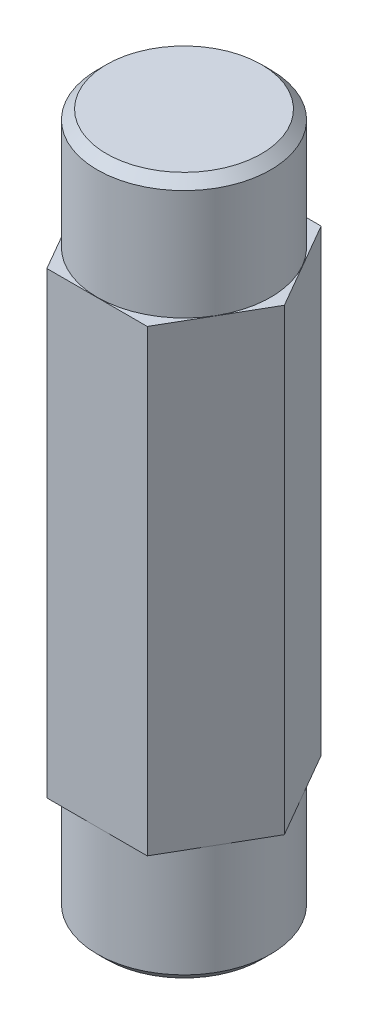
ISO-10303-21;
HEADER;
FILE_DESCRIPTION(('STEP AP214'),'2;1');
FILE_NAME('part.step','',(''),(''),'','','');
FILE_SCHEMA(('AUTOMOTIVE_DESIGN { 1 0 10303 214 1 1 1 1 }'));
ENDSEC;
DATA;
#1=APPLICATION_CONTEXT('core data for automotive mechanical design processes');
#2=APPLICATION_PROTOCOL_DEFINITION('international standard','automotive_design',2000,#1);
#3=PRODUCT_CONTEXT('',#1,'mechanical');
#4=PRODUCT('Part','Part','',(#3));
#5=PRODUCT_RELATED_PRODUCT_CATEGORY('part','',(#4));
#6=PRODUCT_DEFINITION_FORMATION('','',#4);
#7=PRODUCT_DEFINITION_CONTEXT('part definition',#1,'design');
#8=PRODUCT_DEFINITION('design','',#6,#7);
#9=PRODUCT_DEFINITION_SHAPE('','',#8);
#10=(LENGTH_UNIT() NAMED_UNIT(*) SI_UNIT(.MILLI.,.METRE.));
#11=(NAMED_UNIT(*) PLANE_ANGLE_UNIT() SI_UNIT($,.RADIAN.));
#12=(NAMED_UNIT(*) SI_UNIT($,.STERADIAN.) SOLID_ANGLE_UNIT());
#13=UNCERTAINTY_MEASURE_WITH_UNIT(LENGTH_MEASURE(1.E-05),#10,'distance_accuracy_value','');
#14=(GEOMETRIC_REPRESENTATION_CONTEXT(3) GLOBAL_UNCERTAINTY_ASSIGNED_CONTEXT((#13)) GLOBAL_UNIT_ASSIGNED_CONTEXT((#10,
#11,#12)) REPRESENTATION_CONTEXT('',''));
#15=CARTESIAN_POINT('',(0.,0.,0.));
#16=DIRECTION('',(0.,0.,1.));
#17=DIRECTION('',(1.,0.,0.));
#18=AXIS2_PLACEMENT_3D('',#15,#16,#17);
#19=CARTESIAN_POINT('',(-44.7233856342443,-25.527,-16.6661167863655));
#20=DIRECTION('',(-0.866025403784439,0.,0.5));
#21=DIRECTION('',(0.5,0.,0.866025403784439));
#22=AXIS2_PLACEMENT_3D('',#19,#20,#21);
#23=PLANE('',#22);
#24=DIRECTION('',(0.,1.,0.));
#25=VECTOR('',#24,1.);
#26=CARTESIAN_POINT('',(-41.9737549772287,-25.527,-11.9036167863655));
#27=LINE('',#26,#25);
#28=CARTESIAN_POINT('',(-41.9737549772287,-25.3238,-11.9036167863655));
#29=VERTEX_POINT('',#28);
#30=CARTESIAN_POINT('',(-41.9737549772287,-0.2032,-11.9036167863655));
#31=VERTEX_POINT('',#30);
#32=EDGE_CURVE('E113',#29,#31,#27,.T.);
#33=ORIENTED_EDGE('',*,*,#32,.T.);
#34=DIRECTION('',(0.5,0.,0.866025403784439));
#35=VECTOR('',#34,1.);
#36=CARTESIAN_POINT('',(-44.7233856342443,-0.2032,-16.6661167863655));
#37=LINE('',#36,#35);
#38=CARTESIAN_POINT('',(-44.7233856342443,-0.2032,-16.6661167863655));
#39=VERTEX_POINT('',#38);
#40=EDGE_CURVE('E100',#39,#31,#37,.T.);
#41=ORIENTED_EDGE('',*,*,#40,.F.);
#42=DIRECTION('',(0.,1.,0.));
#43=VECTOR('',#42,1.);
#44=CARTESIAN_POINT('',(-44.7233856342443,-25.527,-16.6661167863655));
#45=LINE('',#44,#43);
#46=CARTESIAN_POINT('',(-44.7233856342443,-25.3238,-16.6661167863655));
#47=VERTEX_POINT('',#46);
#48=EDGE_CURVE('E111',#47,#39,#45,.T.);
#49=ORIENTED_EDGE('',*,*,#48,.F.);
#50=DIRECTION('',(-0.5,0.,-0.866025403784439));
#51=VECTOR('',#50,1.);
#52=CARTESIAN_POINT('',(-41.9737549772287,-25.3238,-11.9036167863655));
#53=LINE('',#52,#51);
#54=EDGE_CURVE('E70',#29,#47,#53,.T.);
#55=ORIENTED_EDGE('',*,*,#54,.F.);
#56=EDGE_LOOP('',(#33,#41,#49,#55));
#57=FACE_BOUND('',#56,.T.);
#58=ADVANCED_FACE('F48',(#57),#23,.T.);
#59=CARTESIAN_POINT('',(-41.9737549772287,-25.527,-11.9036167863655));
#60=DIRECTION('',(0.,0.,1.));
#61=DIRECTION('',(1.,0.,0.));
#62=AXIS2_PLACEMENT_3D('',#59,#60,#61);
#63=PLANE('',#62);
#64=DIRECTION('',(0.,1.,0.));
#65=VECTOR('',#64,1.);
#66=CARTESIAN_POINT('',(-36.4744936631975,-25.527,-11.9036167863655));
#67=LINE('',#66,#65);
#68=CARTESIAN_POINT('',(-36.4744936631975,-25.3238,-11.9036167863655));
#69=VERTEX_POINT('',#68);
#70=CARTESIAN_POINT('',(-36.4744936631975,-0.2032,-11.9036167863655));
#71=VERTEX_POINT('',#70);
#72=EDGE_CURVE('E132',#69,#71,#67,.T.);
#73=ORIENTED_EDGE('',*,*,#72,.T.);
#74=DIRECTION('',(1.,0.,0.));
#75=VECTOR('',#74,1.);
#76=CARTESIAN_POINT('',(-41.9737549772287,-0.2032,-11.9036167863655));
#77=LINE('',#76,#75);
#78=EDGE_CURVE('E114',#31,#71,#77,.T.);
#79=ORIENTED_EDGE('',*,*,#78,.F.);
#80=ORIENTED_EDGE('',*,*,#32,.F.);
#81=DIRECTION('',(-1.,0.,0.));
#82=VECTOR('',#81,1.);
#83=CARTESIAN_POINT('',(-36.4744936631975,-25.3238,-11.9036167863655));
#84=LINE('',#83,#82);
#85=EDGE_CURVE('E216',#69,#29,#84,.T.);
#86=ORIENTED_EDGE('',*,*,#85,.F.);
#87=EDGE_LOOP('',(#73,#79,#80,#86));
#88=FACE_BOUND('',#87,.T.);
#89=ADVANCED_FACE('F164',(#88),#63,.T.);
#90=CARTESIAN_POINT('',(-36.4744936631975,-25.527,-11.9036167863655));
#91=DIRECTION('',(0.866025403784438,0.,0.500000000000001));
#92=DIRECTION('',(0.500000000000001,0.,-0.866025403784438));
#93=AXIS2_PLACEMENT_3D('',#90,#91,#92);
#94=PLANE('',#93);
#95=DIRECTION('',(0.,1.,0.));
#96=VECTOR('',#95,1.);
#97=CARTESIAN_POINT('',(-33.7248630061819,-25.527,-16.6661167863655));
#98=LINE('',#97,#96);
#99=CARTESIAN_POINT('',(-33.7248630061819,-25.3238,-16.6661167863655));
#100=VERTEX_POINT('',#99);
#101=CARTESIAN_POINT('',(-33.7248630061819,-0.2032,-16.6661167863655));
#102=VERTEX_POINT('',#101);
#103=EDGE_CURVE('E129',#100,#102,#98,.T.);
#104=ORIENTED_EDGE('',*,*,#103,.T.);
#105=DIRECTION('',(0.500000000000001,0.,-0.866025403784438));
#106=VECTOR('',#105,1.);
#107=CARTESIAN_POINT('',(-36.4744936631975,-0.2032,-11.9036167863655));
#108=LINE('',#107,#106);
#109=EDGE_CURVE('E208',#71,#102,#108,.T.);
#110=ORIENTED_EDGE('',*,*,#109,.F.);
#111=ORIENTED_EDGE('',*,*,#72,.F.);
#112=DIRECTION('',(-0.500000000000001,0.,0.866025403784438));
#113=VECTOR('',#112,1.);
#114=CARTESIAN_POINT('',(-33.7248630061819,-25.3238,-16.6661167863655));
#115=LINE('',#114,#113);
#116=EDGE_CURVE('E119',#100,#69,#115,.T.);
#117=ORIENTED_EDGE('',*,*,#116,.F.);
#118=EDGE_LOOP('',(#104,#110,#111,#117));
#119=FACE_BOUND('',#118,.T.);
#120=ADVANCED_FACE('F168',(#119),#94,.T.);
#121=CARTESIAN_POINT('',(-33.7248630061819,-25.527,-16.6661167863655));
#122=DIRECTION('',(0.866025403784439,0.,-0.5));
#123=DIRECTION('',(-0.5,0.,-0.866025403784439));
#124=AXIS2_PLACEMENT_3D('',#121,#122,#123);
#125=PLANE('',#124);
#126=DIRECTION('',(0.,1.,0.));
#127=VECTOR('',#126,1.);
#128=CARTESIAN_POINT('',(-36.4744936631975,-25.527,-21.4286167863655));
#129=LINE('',#128,#127);
#130=CARTESIAN_POINT('',(-36.4744936631975,-25.3238,-21.4286167863655));
#131=VERTEX_POINT('',#130);
#132=CARTESIAN_POINT('',(-36.4744936631975,-0.2032,-21.4286167863655));
#133=VERTEX_POINT('',#132);
#134=EDGE_CURVE('E121',#131,#133,#129,.T.);
#135=ORIENTED_EDGE('',*,*,#134,.T.);
#136=DIRECTION('',(-0.5,0.,-0.866025403784439));
#137=VECTOR('',#136,1.);
#138=CARTESIAN_POINT('',(-33.7248630061819,-0.2032,-16.6661167863655));
#139=LINE('',#138,#137);
#140=EDGE_CURVE('E210',#102,#133,#139,.T.);
#141=ORIENTED_EDGE('',*,*,#140,.F.);
#142=ORIENTED_EDGE('',*,*,#103,.F.);
#143=DIRECTION('',(0.5,0.,0.866025403784439));
#144=VECTOR('',#143,1.);
#145=CARTESIAN_POINT('',(-36.4744936631975,-25.3238,-21.4286167863655));
#146=LINE('',#145,#144);
#147=EDGE_CURVE('E123',#131,#100,#146,.T.);
#148=ORIENTED_EDGE('',*,*,#147,.F.);
#149=EDGE_LOOP('',(#135,#141,#142,#148));
#150=FACE_BOUND('',#149,.T.);
#151=ADVANCED_FACE('F173',(#150),#125,.T.);
#152=CARTESIAN_POINT('',(-36.4744936631975,-25.527,-21.4286167863655));
#153=DIRECTION('',(0.,0.,-1.));
#154=DIRECTION('',(-1.,0.,0.));
#155=AXIS2_PLACEMENT_3D('',#152,#153,#154);
#156=PLANE('',#155);
#157=DIRECTION('',(0.,1.,0.));
#158=VECTOR('',#157,1.);
#159=CARTESIAN_POINT('',(-41.9737549772287,-25.527,-21.4286167863655));
#160=LINE('',#159,#158);
#161=CARTESIAN_POINT('',(-41.9737549772287,-25.3238,-21.4286167863655));
#162=VERTEX_POINT('',#161);
#163=CARTESIAN_POINT('',(-41.9737549772287,-0.203200000000001,-21.4286167863655));
#164=VERTEX_POINT('',#163);
#165=EDGE_CURVE('E118',#162,#164,#160,.T.);
#166=ORIENTED_EDGE('',*,*,#165,.T.);
#167=DIRECTION('',(-1.,0.,0.));
#168=VECTOR('',#167,1.);
#169=CARTESIAN_POINT('',(-36.4744936631975,-0.2032,-21.4286167863655));
#170=LINE('',#169,#168);
#171=EDGE_CURVE('E62',#133,#164,#170,.T.);
#172=ORIENTED_EDGE('',*,*,#171,.F.);
#173=ORIENTED_EDGE('',*,*,#134,.F.);
#174=DIRECTION('',(1.,0.,0.));
#175=VECTOR('',#174,1.);
#176=CARTESIAN_POINT('',(-41.9737549772287,-25.3238,-21.4286167863655));
#177=LINE('',#176,#175);
#178=EDGE_CURVE('E220',#162,#131,#177,.T.);
#179=ORIENTED_EDGE('',*,*,#178,.F.);
#180=EDGE_LOOP('',(#166,#172,#173,#179));
#181=FACE_BOUND('',#180,.T.);
#182=ADVANCED_FACE('F179',(#181),#156,.T.);
#183=CARTESIAN_POINT('',(-41.9737549772287,-25.527,-21.4286167863655));
#184=DIRECTION('',(-0.866025403784438,0.,-0.500000000000001));
#185=DIRECTION('',(-0.500000000000001,0.,0.866025403784438));
#186=AXIS2_PLACEMENT_3D('',#183,#184,#185);
#187=PLANE('',#186);
#188=ORIENTED_EDGE('',*,*,#48,.T.);
#189=DIRECTION('',(-0.500000000000001,0.,0.866025403784438));
#190=VECTOR('',#189,1.);
#191=CARTESIAN_POINT('',(-41.9737549772287,-0.2032,-21.4286167863655));
#192=LINE('',#191,#190);
#193=EDGE_CURVE('E97',#164,#39,#192,.T.);
#194=ORIENTED_EDGE('',*,*,#193,.F.);
#195=ORIENTED_EDGE('',*,*,#165,.F.);
#196=DIRECTION('',(0.500000000000001,0.,-0.866025403784438));
#197=VECTOR('',#196,1.);
#198=CARTESIAN_POINT('',(-44.7233856342443,-25.3238,-16.6661167863655));
#199=LINE('',#198,#197);
#200=EDGE_CURVE('E117',#47,#162,#199,.T.);
#201=ORIENTED_EDGE('',*,*,#200,.F.);
#202=EDGE_LOOP('',(#188,#194,#195,#201));
#203=FACE_BOUND('',#202,.T.);
#204=ADVANCED_FACE('F116',(#203),#187,.T.);
#205=CARTESIAN_POINT('',(-41.9737549772287,-25.3238,-11.9036167863655));
#206=DIRECTION('',(0.,-1.,0.));
#207=DIRECTION('',(0.,0.,-1.));
#208=AXIS2_PLACEMENT_3D('',#205,#206,#207);
#209=PLANE('',#208);
#210=CARTESIAN_POINT('',(-39.2241243202131,-25.3238,-16.6661167863655));
#211=DIRECTION('',(0.,-1.,0.));
#212=DIRECTION('',(0.,0.,-1.));
#213=AXIS2_PLACEMENT_3D('',#210,#211,#212);
#214=CIRCLE('',#213,4.7498);
#215=CARTESIAN_POINT('',(-39.2241243202131,-25.3238,-21.4159167863655));
#216=VERTEX_POINT('',#215);
#217=EDGE_CURVE('E213',#216,#216,#214,.T.);
#218=ORIENTED_EDGE('',*,*,#217,.F.);
#219=EDGE_LOOP('',(#218));
#220=FACE_BOUND('',#219,.T.);
#221=ORIENTED_EDGE('',*,*,#85,.T.);
#222=ORIENTED_EDGE('',*,*,#54,.T.);
#223=ORIENTED_EDGE('',*,*,#200,.T.);
#224=ORIENTED_EDGE('',*,*,#178,.T.);
#225=ORIENTED_EDGE('',*,*,#147,.T.);
#226=ORIENTED_EDGE('',*,*,#116,.T.);
#227=EDGE_LOOP('',(#221,#222,#223,#224,#225,#226));
#228=FACE_BOUND('',#227,.T.);
#229=ADVANCED_FACE('F157',(#220,#228),#209,.T.);
#230=CARTESIAN_POINT('',(-39.2241243202131,-31.877,-16.6661167863655));
#231=DIRECTION('',(0.,1.,0.));
#232=DIRECTION('',(0.,0.,1.));
#233=AXIS2_PLACEMENT_3D('',#230,#231,#232);
#234=PLANE('',#233);
#235=CARTESIAN_POINT('',(-39.2241243202131,-31.877,-16.6661167863655));
#236=DIRECTION('',(0.,1.,0.));
#237=DIRECTION('',(0.,0.,1.));
#238=AXIS2_PLACEMENT_3D('',#235,#236,#237);
#239=CIRCLE('',#238,4.2418);
#240=CARTESIAN_POINT('',(-39.2241243202131,-31.877,-12.4243167863655));
#241=VERTEX_POINT('',#240);
#242=EDGE_CURVE('E11',#241,#241,#239,.F.);
#243=ORIENTED_EDGE('',*,*,#242,.T.);
#244=EDGE_LOOP('',(#243));
#245=FACE_BOUND('',#244,.T.);
#246=ADVANCED_FACE('F149',(#245),#234,.F.);
#247=CARTESIAN_POINT('',(-39.2241243202131,-31.369,-16.6661167863655));
#248=DIRECTION('',(0.,1.,0.));
#249=DIRECTION('',(0.,0.,1.));
#250=AXIS2_PLACEMENT_3D('',#247,#248,#249);
#251=CONICAL_SURFACE('',#250,4.7498,0.78539816339745);
#252=ORIENTED_EDGE('',*,*,#242,.F.);
#253=EDGE_LOOP('',(#252));
#254=FACE_BOUND('',#253,.T.);
#255=CARTESIAN_POINT('',(-39.2241243202131,-31.369,-16.6661167863655));
#256=DIRECTION('',(0.,1.,0.));
#257=DIRECTION('',(0.,0.,1.));
#258=AXIS2_PLACEMENT_3D('',#255,#256,#257);
#259=CIRCLE('',#258,4.7498);
#260=CARTESIAN_POINT('',(-39.2241243202131,-31.369,-11.9163167863655));
#261=VERTEX_POINT('',#260);
#262=EDGE_CURVE('E55',#261,#261,#259,.T.);
#263=ORIENTED_EDGE('',*,*,#262,.F.);
#264=EDGE_LOOP('',(#263));
#265=FACE_BOUND('',#264,.T.);
#266=ADVANCED_FACE('F147',(#254,#265),#251,.T.);
#267=CARTESIAN_POINT('',(-39.2241243202131,-31.877,-16.6661167863655));
#268=DIRECTION('',(0.,1.,0.));
#269=DIRECTION('',(0.,0.,1.));
#270=AXIS2_PLACEMENT_3D('',#267,#268,#269);
#271=CYLINDRICAL_SURFACE('',#270,4.7498);
#272=ORIENTED_EDGE('',*,*,#262,.T.);
#273=EDGE_LOOP('',(#272));
#274=FACE_BOUND('',#273,.T.);
#275=ORIENTED_EDGE('',*,*,#217,.T.);
#276=EDGE_LOOP('',(#275));
#277=FACE_BOUND('',#276,.T.);
#278=ADVANCED_FACE('F144',(#274,#277),#271,.T.);
#279=CARTESIAN_POINT('',(-44.7233856342443,-0.2032,-16.6661167863655));
#280=DIRECTION('',(0.,1.,0.));
#281=DIRECTION('',(0.,0.,1.));
#282=AXIS2_PLACEMENT_3D('',#279,#280,#281);
#283=PLANE('',#282);
#284=CARTESIAN_POINT('',(-39.2241243202131,-0.2032,-16.6661167863655));
#285=DIRECTION('',(0.,1.,0.));
#286=DIRECTION('',(0.,0.,1.));
#287=AXIS2_PLACEMENT_3D('',#284,#285,#286);
#288=CIRCLE('',#287,4.7498);
#289=CARTESIAN_POINT('',(-39.2241243202131,-0.2032,-11.9163167863655));
#290=VERTEX_POINT('',#289);
#291=EDGE_CURVE('E106',#290,#290,#288,.T.);
#292=ORIENTED_EDGE('',*,*,#291,.F.);
#293=EDGE_LOOP('',(#292));
#294=FACE_BOUND('',#293,.T.);
#295=ORIENTED_EDGE('',*,*,#193,.T.);
#296=ORIENTED_EDGE('',*,*,#40,.T.);
#297=ORIENTED_EDGE('',*,*,#78,.T.);
#298=ORIENTED_EDGE('',*,*,#109,.T.);
#299=ORIENTED_EDGE('',*,*,#140,.T.);
#300=ORIENTED_EDGE('',*,*,#171,.T.);
#301=EDGE_LOOP('',(#295,#296,#297,#298,#299,#300));
#302=FACE_BOUND('',#301,.T.);
#303=ADVANCED_FACE('F99',(#294,#302),#283,.T.);
#304=CARTESIAN_POINT('',(-39.2241243202131,6.35,-16.6661167863655));
#305=DIRECTION('',(0.,-1.,0.));
#306=DIRECTION('',(0.,0.,-1.));
#307=AXIS2_PLACEMENT_3D('',#304,#305,#306);
#308=PLANE('',#307);
#309=CARTESIAN_POINT('',(-39.2241243202131,6.35,-16.6661167863655));
#310=DIRECTION('',(0.,-1.,0.));
#311=DIRECTION('',(0.,0.,-1.));
#312=AXIS2_PLACEMENT_3D('',#309,#310,#311);
#313=CIRCLE('',#312,4.2418);
#314=CARTESIAN_POINT('',(-39.2241243202131,6.35,-20.9079167863655));
#315=VERTEX_POINT('',#314);
#316=EDGE_CURVE('E139',#315,#315,#313,.F.);
#317=ORIENTED_EDGE('',*,*,#316,.T.);
#318=EDGE_LOOP('',(#317));
#319=FACE_BOUND('',#318,.T.);
#320=ADVANCED_FACE('F191',(#319),#308,.F.);
#321=CARTESIAN_POINT('',(-39.2241243202131,5.842,-16.6661167863655));
#322=DIRECTION('',(0.,-1.,0.));
#323=DIRECTION('',(0.,0.,-1.));
#324=AXIS2_PLACEMENT_3D('',#321,#322,#323);
#325=CONICAL_SURFACE('',#324,4.7498,0.785398163397452);
#326=ORIENTED_EDGE('',*,*,#316,.F.);
#327=EDGE_LOOP('',(#326));
#328=FACE_BOUND('',#327,.T.);
#329=CARTESIAN_POINT('',(-39.2241243202131,5.842,-16.6661167863655));
#330=DIRECTION('',(0.,-1.,0.));
#331=DIRECTION('',(0.,0.,-1.));
#332=AXIS2_PLACEMENT_3D('',#329,#330,#331);
#333=CIRCLE('',#332,4.7498);
#334=CARTESIAN_POINT('',(-39.2241243202131,5.842,-21.4159167863655));
#335=VERTEX_POINT('',#334);
#336=EDGE_CURVE('E136',#335,#335,#333,.T.);
#337=ORIENTED_EDGE('',*,*,#336,.F.);
#338=EDGE_LOOP('',(#337));
#339=FACE_BOUND('',#338,.T.);
#340=ADVANCED_FACE('F189',(#328,#339),#325,.T.);
#341=CARTESIAN_POINT('',(-39.2241243202131,6.35,-16.6661167863655));
#342=DIRECTION('',(0.,-1.,0.));
#343=DIRECTION('',(0.,0.,-1.));
#344=AXIS2_PLACEMENT_3D('',#341,#342,#343);
#345=CYLINDRICAL_SURFACE('',#344,4.7498);
#346=ORIENTED_EDGE('',*,*,#336,.T.);
#347=EDGE_LOOP('',(#346));
#348=FACE_BOUND('',#347,.T.);
#349=ORIENTED_EDGE('',*,*,#291,.T.);
#350=EDGE_LOOP('',(#349));
#351=FACE_BOUND('',#350,.T.);
#352=ADVANCED_FACE('F186',(#348,#351),#345,.T.);
#353=CLOSED_SHELL('',(#58,#89,#120,#151,#182,#204,#229,#246,#266,#278,#303,#320,#340,#352));
#354=MANIFOLD_SOLID_BREP('B2',#353);
#355=ADVANCED_BREP_SHAPE_REPRESENTATION('',(#18,#354),#14);
#356=SHAPE_DEFINITION_REPRESENTATION(#9,#355);
ENDSEC;
END-ISO-10303-21;
